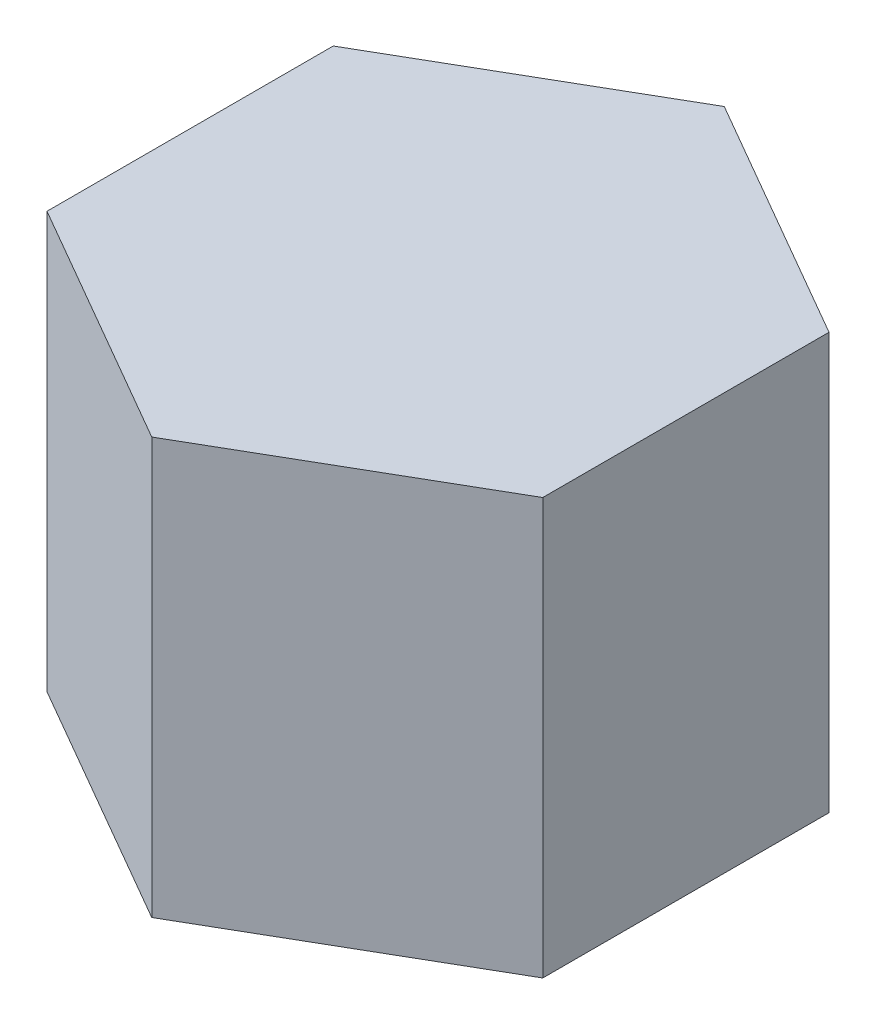
ISO-10303-21;
HEADER;
FILE_DESCRIPTION(('STEP AP214'),'2;1');
FILE_NAME('part.step','',(''),(''),'','','');
FILE_SCHEMA(('AUTOMOTIVE_DESIGN { 1 0 10303 214 1 1 1 1 }'));
ENDSEC;
DATA;
#1=APPLICATION_CONTEXT('core data for automotive mechanical design processes');
#2=APPLICATION_PROTOCOL_DEFINITION('international standard','automotive_design',2000,#1);
#3=PRODUCT_CONTEXT('',#1,'mechanical');
#4=PRODUCT('Part','Part','',(#3));
#5=PRODUCT_RELATED_PRODUCT_CATEGORY('part','',(#4));
#6=PRODUCT_DEFINITION_FORMATION('','',#4);
#7=PRODUCT_DEFINITION_CONTEXT('part definition',#1,'design');
#8=PRODUCT_DEFINITION('design','',#6,#7);
#9=PRODUCT_DEFINITION_SHAPE('','',#8);
#10=(LENGTH_UNIT() NAMED_UNIT(*) SI_UNIT(.MILLI.,.METRE.));
#11=(NAMED_UNIT(*) PLANE_ANGLE_UNIT() SI_UNIT($,.RADIAN.));
#12=(NAMED_UNIT(*) SI_UNIT($,.STERADIAN.) SOLID_ANGLE_UNIT());
#13=UNCERTAINTY_MEASURE_WITH_UNIT(LENGTH_MEASURE(1.E-05),#10,'distance_accuracy_value','');
#14=(GEOMETRIC_REPRESENTATION_CONTEXT(3) GLOBAL_UNCERTAINTY_ASSIGNED_CONTEXT((#13)) GLOBAL_UNIT_ASSIGNED_CONTEXT((#10,
#11,#12)) REPRESENTATION_CONTEXT('',''));
#15=CARTESIAN_POINT('',(0.,0.,0.));
#16=DIRECTION('',(0.,0.,1.));
#17=DIRECTION('',(1.,0.,0.));
#18=AXIS2_PLACEMENT_3D('',#15,#16,#17);
#19=CARTESIAN_POINT('',(209.339551417382,-147.556598747966,291.681971220494));
#20=DIRECTION('',(-0.500000000000028,0.,-0.866025403784422));
#21=DIRECTION('',(-0.866025403784423,0.,0.500000000000028));
#22=AXIS2_PLACEMENT_3D('',#19,#20,#21);
#23=PLANE('',#22);
#24=CARTESIAN_POINT('',(209.642660308706,-147.047793579175,291.506971220494));
#25=DIRECTION('',(-0.866025403784422,0.,0.500000000000028));
#26=VECTOR('',#25,1.);
#27=LINE('',#24,#26);
#28=CARTESIAN_POINT('',(209.642660308706,-147.047793579175,291.506971220494));
#29=VERTEX_POINT('',#28);
#30=CARTESIAN_POINT('',(209.339551417382,-147.047793579175,291.681971220494));
#31=VERTEX_POINT('',#30);
#32=EDGE_CURVE('E170',#29,#31,#27,.T.);
#33=ORIENTED_EDGE('',*,*,#32,.T.);
#34=CARTESIAN_POINT('',(209.339551417382,-147.556598747966,291.681971220494));
#35=DIRECTION('',(0.,1.,0.));
#36=VECTOR('',#35,1.);
#37=LINE('',#34,#36);
#38=CARTESIAN_POINT('',(209.339551417382,-147.556598747966,291.681971220494));
#39=VERTEX_POINT('',#38);
#40=EDGE_CURVE('E35',#39,#31,#37,.T.);
#41=ORIENTED_EDGE('',*,*,#40,.F.);
#42=CARTESIAN_POINT('',(209.642660308706,-147.556598747966,291.506971220494));
#43=DIRECTION('',(-0.866025403784422,0.,0.500000000000028));
#44=VECTOR('',#43,1.);
#45=LINE('',#42,#44);
#46=CARTESIAN_POINT('',(209.642660308706,-147.556598747966,291.506971220494));
#47=VERTEX_POINT('',#46);
#48=EDGE_CURVE('E159',#47,#39,#45,.T.);
#49=ORIENTED_EDGE('',*,*,#48,.F.);
#50=CARTESIAN_POINT('',(209.642660308706,-147.556598747966,291.506971220494));
#51=DIRECTION('',(0.,1.,0.));
#52=VECTOR('',#51,1.);
#53=LINE('',#50,#52);
#54=EDGE_CURVE('E10',#47,#29,#53,.T.);
#55=ORIENTED_EDGE('',*,*,#54,.T.);
#56=EDGE_LOOP('',(#33,#41,#49,#55));
#57=FACE_BOUND('',#56,.T.);
#58=ADVANCED_FACE('F16',(#57),#23,.F.);
#59=CARTESIAN_POINT('',(209.642660308706,-147.556598747966,291.594471220494));
#60=DIRECTION('',(-1.,0.,0.));
#61=DIRECTION('',(0.,-1.,0.));
#62=AXIS2_PLACEMENT_3D('',#59,#60,#61);
#63=PLANE('',#62);
#64=CARTESIAN_POINT('',(209.642660308706,-147.047793579175,291.156971220494));
#65=DIRECTION('',(0.,0.,1.));
#66=VECTOR('',#65,1.);
#67=LINE('',#64,#66);
#68=CARTESIAN_POINT('',(209.642660308706,-147.047793579175,291.156971220494));
#69=VERTEX_POINT('',#68);
#70=EDGE_CURVE('E167',#69,#29,#67,.T.);
#71=ORIENTED_EDGE('',*,*,#70,.T.);
#72=ORIENTED_EDGE('',*,*,#54,.F.);
#73=CARTESIAN_POINT('',(209.642660308706,-147.556598747966,291.156971220494));
#74=DIRECTION('',(0.,0.,1.));
#75=VECTOR('',#74,1.);
#76=LINE('',#73,#75);
#77=CARTESIAN_POINT('',(209.642660308706,-147.556598747966,291.156971220494));
#78=VERTEX_POINT('',#77);
#79=EDGE_CURVE('E156',#78,#47,#76,.T.);
#80=ORIENTED_EDGE('',*,*,#79,.F.);
#81=CARTESIAN_POINT('',(209.642660308706,-147.556598747966,291.156971220494));
#82=DIRECTION('',(0.,1.,0.));
#83=VECTOR('',#82,1.);
#84=LINE('',#81,#83);
#85=EDGE_CURVE('E27',#78,#69,#84,.T.);
#86=ORIENTED_EDGE('',*,*,#85,.T.);
#87=EDGE_LOOP('',(#71,#72,#80,#86));
#88=FACE_BOUND('',#87,.T.);
#89=ADVANCED_FACE('F189',(#88),#63,.F.);
#90=CARTESIAN_POINT('',(209.642660308706,-147.556598747966,291.156971220494));
#91=DIRECTION('',(-0.499999999999943,0.,0.866025403784471));
#92=DIRECTION('',(0.866025403784471,0.,0.499999999999943));
#93=AXIS2_PLACEMENT_3D('',#90,#91,#92);
#94=PLANE('',#93);
#95=CARTESIAN_POINT('',(209.339551417382,-147.047793579175,290.981971220494));
#96=DIRECTION('',(0.866025403784471,0.,0.499999999999943));
#97=VECTOR('',#96,1.);
#98=LINE('',#95,#97);
#99=CARTESIAN_POINT('',(209.339551417382,-147.047793579175,290.981971220494));
#100=VERTEX_POINT('',#99);
#101=EDGE_CURVE('E163',#100,#69,#98,.T.);
#102=ORIENTED_EDGE('',*,*,#101,.T.);
#103=ORIENTED_EDGE('',*,*,#85,.F.);
#104=CARTESIAN_POINT('',(209.339551417382,-147.556598747966,290.981971220494));
#105=DIRECTION('',(0.866025403784471,0.,0.499999999999943));
#106=VECTOR('',#105,1.);
#107=LINE('',#104,#106);
#108=CARTESIAN_POINT('',(209.339551417382,-147.556598747966,290.981971220494));
#109=VERTEX_POINT('',#108);
#110=EDGE_CURVE('E106',#109,#78,#107,.T.);
#111=ORIENTED_EDGE('',*,*,#110,.F.);
#112=CARTESIAN_POINT('',(209.339551417382,-147.556598747966,290.981971220494));
#113=DIRECTION('',(0.,1.,0.));
#114=VECTOR('',#113,1.);
#115=LINE('',#112,#114);
#116=EDGE_CURVE('E94',#109,#100,#115,.T.);
#117=ORIENTED_EDGE('',*,*,#116,.T.);
#118=EDGE_LOOP('',(#102,#103,#111,#117));
#119=FACE_BOUND('',#118,.T.);
#120=ADVANCED_FACE('F198',(#119),#94,.F.);
#121=CARTESIAN_POINT('',(209.339551417382,-147.556598747966,290.981971220494));
#122=DIRECTION('',(0.499999999999978,0.,0.866025403784452));
#123=DIRECTION('',(0.866025403784452,0.,-0.499999999999978));
#124=AXIS2_PLACEMENT_3D('',#121,#122,#123);
#125=PLANE('',#124);
#126=CARTESIAN_POINT('',(209.036442526057,-147.047793579175,291.156971220494));
#127=DIRECTION('',(0.866025403784452,0.,-0.499999999999978));
#128=VECTOR('',#127,1.);
#129=LINE('',#126,#128);
#130=CARTESIAN_POINT('',(209.036442526057,-147.047793579175,291.156971220494));
#131=VERTEX_POINT('',#130);
#132=EDGE_CURVE('E162',#131,#100,#129,.T.);
#133=ORIENTED_EDGE('',*,*,#132,.T.);
#134=ORIENTED_EDGE('',*,*,#116,.F.);
#135=CARTESIAN_POINT('',(209.036442526057,-147.556598747966,291.156971220494));
#136=DIRECTION('',(0.866025403784452,0.,-0.499999999999978));
#137=VECTOR('',#136,1.);
#138=LINE('',#135,#137);
#139=CARTESIAN_POINT('',(209.036442526057,-147.556598747966,291.156971220494));
#140=VERTEX_POINT('',#139);
#141=EDGE_CURVE('E98',#140,#109,#138,.T.);
#142=ORIENTED_EDGE('',*,*,#141,.F.);
#143=CARTESIAN_POINT('',(209.036442526057,-147.556598747966,291.156971220494));
#144=DIRECTION('',(0.,1.,0.));
#145=VECTOR('',#144,1.);
#146=LINE('',#143,#145);
#147=EDGE_CURVE('E79',#140,#131,#146,.T.);
#148=ORIENTED_EDGE('',*,*,#147,.T.);
#149=EDGE_LOOP('',(#133,#134,#142,#148));
#150=FACE_BOUND('',#149,.T.);
#151=ADVANCED_FACE('F100',(#150),#125,.F.);
#152=CARTESIAN_POINT('',(209.036442526057,-147.556598747966,291.594471220494));
#153=DIRECTION('',(1.,0.,0.));
#154=DIRECTION('',(0.,1.,0.));
#155=AXIS2_PLACEMENT_3D('',#152,#153,#154);
#156=PLANE('',#155);
#157=CARTESIAN_POINT('',(209.036442526057,-147.047793579175,291.506971220494));
#158=DIRECTION('',(0.,0.,-1.));
#159=VECTOR('',#158,1.);
#160=LINE('',#157,#159);
#161=CARTESIAN_POINT('',(209.036442526057,-147.047793579175,291.506971220494));
#162=VERTEX_POINT('',#161);
#163=EDGE_CURVE('E88',#162,#131,#160,.T.);
#164=ORIENTED_EDGE('',*,*,#163,.T.);
#165=ORIENTED_EDGE('',*,*,#147,.F.);
#166=CARTESIAN_POINT('',(209.036442526057,-147.556598747966,291.506971220494));
#167=DIRECTION('',(0.,0.,-1.));
#168=VECTOR('',#167,1.);
#169=LINE('',#166,#168);
#170=CARTESIAN_POINT('',(209.036442526057,-147.556598747966,291.506971220494));
#171=VERTEX_POINT('',#170);
#172=EDGE_CURVE('E84',#171,#140,#169,.T.);
#173=ORIENTED_EDGE('',*,*,#172,.F.);
#174=CARTESIAN_POINT('',(209.036442526057,-147.556598747966,291.506971220494));
#175=DIRECTION('',(0.,1.,0.));
#176=VECTOR('',#175,1.);
#177=LINE('',#174,#176);
#178=EDGE_CURVE('E58',#171,#162,#177,.T.);
#179=ORIENTED_EDGE('',*,*,#178,.T.);
#180=EDGE_LOOP('',(#164,#165,#173,#179));
#181=FACE_BOUND('',#180,.T.);
#182=ADVANCED_FACE('F82',(#181),#156,.F.);
#183=CARTESIAN_POINT('',(209.036442526057,-147.556598747966,291.506971220494));
#184=DIRECTION('',(0.499999999999978,0.,-0.866025403784452));
#185=DIRECTION('',(-0.866025403784452,0.,-0.499999999999978));
#186=AXIS2_PLACEMENT_3D('',#183,#184,#185);
#187=PLANE('',#186);
#188=CARTESIAN_POINT('',(209.339551417382,-147.047793579175,291.681971220494));
#189=DIRECTION('',(-0.866025403784452,0.,-0.499999999999978));
#190=VECTOR('',#189,1.);
#191=LINE('',#188,#190);
#192=EDGE_CURVE('E160',#31,#162,#191,.T.);
#193=ORIENTED_EDGE('',*,*,#192,.T.);
#194=ORIENTED_EDGE('',*,*,#178,.F.);
#195=CARTESIAN_POINT('',(209.339551417382,-147.556598747966,291.681971220494));
#196=DIRECTION('',(-0.866025403784452,0.,-0.499999999999978));
#197=VECTOR('',#196,1.);
#198=LINE('',#195,#197);
#199=EDGE_CURVE('E112',#39,#171,#198,.T.);
#200=ORIENTED_EDGE('',*,*,#199,.F.);
#201=ORIENTED_EDGE('',*,*,#40,.T.);
#202=EDGE_LOOP('',(#193,#194,#200,#201));
#203=FACE_BOUND('',#202,.T.);
#204=ADVANCED_FACE('F131',(#203),#187,.F.);
#205=CARTESIAN_POINT('',(206.491105863044,-147.556598747966,291.594471220494));
#206=DIRECTION('',(0.,1.,0.));
#207=DIRECTION('',(-1.,0.,0.));
#208=AXIS2_PLACEMENT_3D('',#205,#206,#207);
#209=PLANE('',#208);
#210=ORIENTED_EDGE('',*,*,#48,.T.);
#211=ORIENTED_EDGE('',*,*,#199,.T.);
#212=ORIENTED_EDGE('',*,*,#172,.T.);
#213=ORIENTED_EDGE('',*,*,#141,.T.);
#214=ORIENTED_EDGE('',*,*,#110,.T.);
#215=ORIENTED_EDGE('',*,*,#79,.T.);
#216=EDGE_LOOP('',(#210,#211,#212,#213,#214,#215));
#217=FACE_BOUND('',#216,.T.);
#218=ADVANCED_FACE('F111',(#217),#209,.F.);
#219=CARTESIAN_POINT('',(206.491105863044,-147.047793579175,291.594471220494));
#220=DIRECTION('',(0.,1.,0.));
#221=DIRECTION('',(-1.,0.,0.));
#222=AXIS2_PLACEMENT_3D('',#219,#220,#221);
#223=PLANE('',#222);
#224=ORIENTED_EDGE('',*,*,#32,.F.);
#225=ORIENTED_EDGE('',*,*,#70,.F.);
#226=ORIENTED_EDGE('',*,*,#101,.F.);
#227=ORIENTED_EDGE('',*,*,#132,.F.);
#228=ORIENTED_EDGE('',*,*,#163,.F.);
#229=ORIENTED_EDGE('',*,*,#192,.F.);
#230=EDGE_LOOP('',(#224,#225,#226,#227,#228,#229));
#231=FACE_BOUND('',#230,.T.);
#232=ADVANCED_FACE('F130',(#231),#223,.T.);
#233=CLOSED_SHELL('',(#58,#89,#120,#151,#182,#204,#218,#232));
#234=MANIFOLD_SOLID_BREP('B1',#233);
#235=ADVANCED_BREP_SHAPE_REPRESENTATION('',(#18,#234),#14);
#236=SHAPE_DEFINITION_REPRESENTATION(#9,#235);
ENDSEC;
END-ISO-10303-21;
